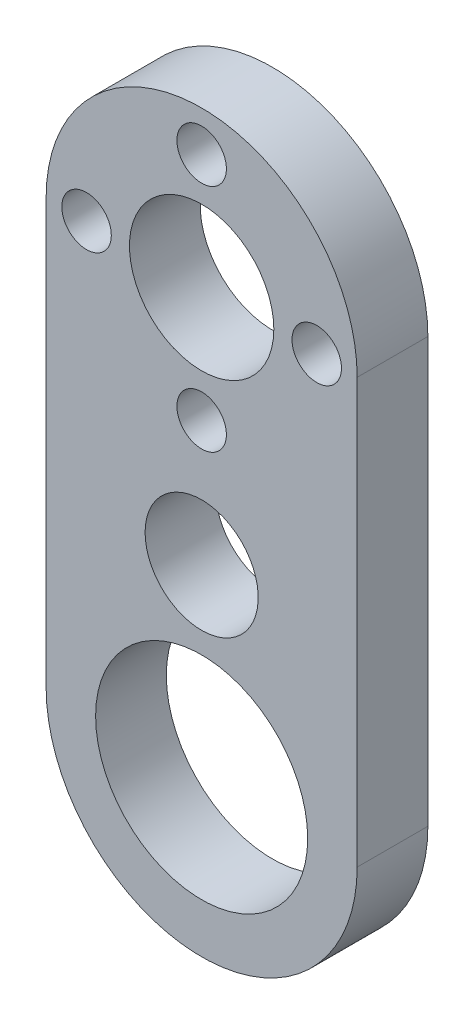
ISO-10303-21;
HEADER;
FILE_DESCRIPTION(('STEP AP214'),'2;1');
FILE_NAME('part.step','',(''),(''),'','','');
FILE_SCHEMA(('AUTOMOTIVE_DESIGN { 1 0 10303 214 1 1 1 1 }'));
ENDSEC;
DATA;
#1=APPLICATION_CONTEXT('core data for automotive mechanical design processes');
#2=APPLICATION_PROTOCOL_DEFINITION('international standard','automotive_design',2000,#1);
#3=PRODUCT_CONTEXT('',#1,'mechanical');
#4=PRODUCT('Part','Part','',(#3));
#5=PRODUCT_RELATED_PRODUCT_CATEGORY('part','',(#4));
#6=PRODUCT_DEFINITION_FORMATION('','',#4);
#7=PRODUCT_DEFINITION_CONTEXT('part definition',#1,'design');
#8=PRODUCT_DEFINITION('design','',#6,#7);
#9=PRODUCT_DEFINITION_SHAPE('','',#8);
#10=(LENGTH_UNIT() NAMED_UNIT(*) SI_UNIT(.MILLI.,.METRE.));
#11=(NAMED_UNIT(*) PLANE_ANGLE_UNIT() SI_UNIT($,.RADIAN.));
#12=(NAMED_UNIT(*) SI_UNIT($,.STERADIAN.) SOLID_ANGLE_UNIT());
#13=UNCERTAINTY_MEASURE_WITH_UNIT(LENGTH_MEASURE(1.E-05),#10,'distance_accuracy_value','');
#14=(GEOMETRIC_REPRESENTATION_CONTEXT(3) GLOBAL_UNCERTAINTY_ASSIGNED_CONTEXT((#13)) GLOBAL_UNIT_ASSIGNED_CONTEXT((#10,
#11,#12)) REPRESENTATION_CONTEXT('',''));
#15=CARTESIAN_POINT('',(0.,0.,0.));
#16=DIRECTION('',(0.,0.,1.));
#17=DIRECTION('',(1.,0.,0.));
#18=AXIS2_PLACEMENT_3D('',#15,#16,#17);
#19=CARTESIAN_POINT('',(0.,0.,5.));
#20=DIRECTION('',(0.,0.,-1.));
#21=DIRECTION('',(-1.,0.,0.));
#22=AXIS2_PLACEMENT_3D('',#19,#20,#21);
#23=CYLINDRICAL_SURFACE('',#22,11.);
#24=DIRECTION('',(0.,0.,-1.));
#25=VECTOR('',#24,1.);
#26=CARTESIAN_POINT('',(-11.,0.,5.));
#27=LINE('',#26,#25);
#28=CARTESIAN_POINT('',(-11.,0.,5.));
#29=VERTEX_POINT('',#28);
#30=CARTESIAN_POINT('',(-11.,0.,0.));
#31=VERTEX_POINT('',#30);
#32=EDGE_CURVE('E56',#29,#31,#27,.T.);
#33=ORIENTED_EDGE('',*,*,#32,.F.);
#34=CARTESIAN_POINT('',(0.,0.,5.));
#35=DIRECTION('',(0.,0.,1.));
#36=DIRECTION('',(1.,0.,0.));
#37=AXIS2_PLACEMENT_3D('',#34,#35,#36);
#38=CIRCLE('',#37,11.);
#39=CARTESIAN_POINT('',(11.,0.,5.));
#40=VERTEX_POINT('',#39);
#41=EDGE_CURVE('E11',#40,#29,#38,.T.);
#42=ORIENTED_EDGE('',*,*,#41,.F.);
#43=DIRECTION('',(0.,0.,-1.));
#44=VECTOR('',#43,1.);
#45=CARTESIAN_POINT('',(11.,0.,5.));
#46=LINE('',#45,#44);
#47=CARTESIAN_POINT('',(11.,0.,0.));
#48=VERTEX_POINT('',#47);
#49=EDGE_CURVE('E87',#40,#48,#46,.T.);
#50=ORIENTED_EDGE('',*,*,#49,.T.);
#51=CARTESIAN_POINT('',(0.,0.,0.));
#52=DIRECTION('',(0.,0.,1.));
#53=DIRECTION('',(1.,0.,0.));
#54=AXIS2_PLACEMENT_3D('',#51,#52,#53);
#55=CIRCLE('',#54,11.);
#56=EDGE_CURVE('E42',#48,#31,#55,.T.);
#57=ORIENTED_EDGE('',*,*,#56,.T.);
#58=EDGE_LOOP('',(#33,#42,#50,#57));
#59=FACE_BOUND('',#58,.T.);
#60=ADVANCED_FACE('F39',(#59),#23,.T.);
#61=CARTESIAN_POINT('',(0.,0.,5.));
#62=DIRECTION('',(0.,0.,1.));
#63=DIRECTION('',(1.,0.,0.));
#64=AXIS2_PLACEMENT_3D('',#61,#62,#63);
#65=PLANE('',#64);
#66=CARTESIAN_POINT('',(8.14,0.,5.));
#67=DIRECTION('',(0.,0.,-1.));
#68=DIRECTION('',(0.,-1.,0.));
#69=AXIS2_PLACEMENT_3D('',#66,#67,#68);
#70=CIRCLE('',#69,1.75);
#71=CARTESIAN_POINT('',(8.14000000000001,-1.74999999999997,5.));
#72=VERTEX_POINT('',#71);
#73=EDGE_CURVE('E116',#72,#72,#70,.T.);
#74=ORIENTED_EDGE('',*,*,#73,.T.);
#75=EDGE_LOOP('',(#74));
#76=FACE_BOUND('',#75,.T.);
#77=CARTESIAN_POINT('',(0.,8.14,5.));
#78=DIRECTION('',(0.,0.,-1.));
#79=DIRECTION('',(1.,0.,0.));
#80=AXIS2_PLACEMENT_3D('',#77,#78,#79);
#81=CIRCLE('',#80,1.75);
#82=CARTESIAN_POINT('',(1.75,8.14,5.));
#83=VERTEX_POINT('',#82);
#84=EDGE_CURVE('E123',#83,#83,#81,.T.);
#85=ORIENTED_EDGE('',*,*,#84,.T.);
#86=EDGE_LOOP('',(#85));
#87=FACE_BOUND('',#86,.T.);
#88=CARTESIAN_POINT('',(-8.14,0.,5.));
#89=DIRECTION('',(0.,0.,-1.));
#90=DIRECTION('',(0.,1.,0.));
#91=AXIS2_PLACEMENT_3D('',#88,#89,#90);
#92=CIRCLE('',#91,1.75);
#93=CARTESIAN_POINT('',(-8.14000000000002,1.74999999999991,5.));
#94=VERTEX_POINT('',#93);
#95=EDGE_CURVE('E129',#94,#94,#92,.T.);
#96=ORIENTED_EDGE('',*,*,#95,.T.);
#97=EDGE_LOOP('',(#96));
#98=FACE_BOUND('',#97,.T.);
#99=CARTESIAN_POINT('',(0.,-8.14,5.));
#100=DIRECTION('',(0.,0.,-1.));
#101=DIRECTION('',(-1.,0.,0.));
#102=AXIS2_PLACEMENT_3D('',#99,#100,#101);
#103=CIRCLE('',#102,1.75);
#104=CARTESIAN_POINT('',(-1.75,-8.14,5.));
#105=VERTEX_POINT('',#104);
#106=EDGE_CURVE('E134',#105,#105,#103,.T.);
#107=ORIENTED_EDGE('',*,*,#106,.T.);
#108=EDGE_LOOP('',(#107));
#109=FACE_BOUND('',#108,.T.);
#110=ORIENTED_EDGE('',*,*,#41,.T.);
#111=DIRECTION('',(0.,1.,0.));
#112=VECTOR('',#111,1.);
#113=CARTESIAN_POINT('',(-11.,0.,5.));
#114=LINE('',#113,#112);
#115=CARTESIAN_POINT('',(-11.,-30.,5.));
#116=VERTEX_POINT('',#115);
#117=EDGE_CURVE('E95',#116,#29,#114,.T.);
#118=ORIENTED_EDGE('',*,*,#117,.F.);
#119=CARTESIAN_POINT('',(0.,-30.,5.));
#120=DIRECTION('',(0.,0.,-1.));
#121=DIRECTION('',(1.,0.,0.));
#122=AXIS2_PLACEMENT_3D('',#119,#120,#121);
#123=CIRCLE('',#122,11.);
#124=CARTESIAN_POINT('',(11.,-30.,5.));
#125=VERTEX_POINT('',#124);
#126=EDGE_CURVE('E78',#125,#116,#123,.T.);
#127=ORIENTED_EDGE('',*,*,#126,.F.);
#128=DIRECTION('',(0.,-1.,0.));
#129=VECTOR('',#128,1.);
#130=CARTESIAN_POINT('',(11.,0.,5.));
#131=LINE('',#130,#129);
#132=EDGE_CURVE('E93',#40,#125,#131,.T.);
#133=ORIENTED_EDGE('',*,*,#132,.F.);
#134=EDGE_LOOP('',(#110,#118,#127,#133));
#135=FACE_BOUND('',#134,.T.);
#136=CARTESIAN_POINT('',(0.,0.,5.));
#137=DIRECTION('',(0.,0.,1.));
#138=DIRECTION('',(1.,0.,0.));
#139=AXIS2_PLACEMENT_3D('',#136,#137,#138);
#140=CIRCLE('',#139,5.105);
#141=CARTESIAN_POINT('',(5.105,0.,5.));
#142=VERTEX_POINT('',#141);
#143=EDGE_CURVE('E140',#142,#142,#140,.T.);
#144=ORIENTED_EDGE('',*,*,#143,.F.);
#145=EDGE_LOOP('',(#144));
#146=FACE_BOUND('',#145,.T.);
#147=CARTESIAN_POINT('',(0.,-17.,5.));
#148=DIRECTION('',(0.,0.,-1.));
#149=DIRECTION('',(-1.,0.,0.));
#150=AXIS2_PLACEMENT_3D('',#147,#148,#149);
#151=CIRCLE('',#150,4.);
#152=CARTESIAN_POINT('',(-4.,-17.,5.));
#153=VERTEX_POINT('',#152);
#154=EDGE_CURVE('E281',#153,#153,#151,.T.);
#155=ORIENTED_EDGE('',*,*,#154,.T.);
#156=EDGE_LOOP('',(#155));
#157=FACE_BOUND('',#156,.T.);
#158=CARTESIAN_POINT('',(0.,-30.,5.));
#159=DIRECTION('',(0.,0.,-1.));
#160=DIRECTION('',(-1.,0.,0.));
#161=AXIS2_PLACEMENT_3D('',#158,#159,#160);
#162=CIRCLE('',#161,7.5);
#163=CARTESIAN_POINT('',(-7.5,-30.,5.));
#164=VERTEX_POINT('',#163);
#165=EDGE_CURVE('E110',#164,#164,#162,.T.);
#166=ORIENTED_EDGE('',*,*,#165,.T.);
#167=EDGE_LOOP('',(#166));
#168=FACE_BOUND('',#167,.T.);
#169=ADVANCED_FACE('F91',(#76,#87,#98,#109,#135,#146,#157,#168),#65,.T.);
#170=CARTESIAN_POINT('',(0.,0.,0.));
#171=DIRECTION('',(0.,0.,1.));
#172=DIRECTION('',(1.,0.,0.));
#173=AXIS2_PLACEMENT_3D('',#170,#171,#172);
#174=PLANE('',#173);
#175=CARTESIAN_POINT('',(8.14,0.,0.));
#176=DIRECTION('',(0.,0.,-1.));
#177=DIRECTION('',(0.,-1.,0.));
#178=AXIS2_PLACEMENT_3D('',#175,#176,#177);
#179=CIRCLE('',#178,1.75);
#180=CARTESIAN_POINT('',(8.14000000000001,-1.74999999999997,0.));
#181=VERTEX_POINT('',#180);
#182=EDGE_CURVE('E120',#181,#181,#179,.T.);
#183=ORIENTED_EDGE('',*,*,#182,.F.);
#184=EDGE_LOOP('',(#183));
#185=FACE_BOUND('',#184,.T.);
#186=CARTESIAN_POINT('',(0.,8.14,0.));
#187=DIRECTION('',(0.,0.,-1.));
#188=DIRECTION('',(1.,0.,0.));
#189=AXIS2_PLACEMENT_3D('',#186,#187,#188);
#190=CIRCLE('',#189,1.75);
#191=CARTESIAN_POINT('',(1.75,8.14,0.));
#192=VERTEX_POINT('',#191);
#193=EDGE_CURVE('E126',#192,#192,#190,.T.);
#194=ORIENTED_EDGE('',*,*,#193,.F.);
#195=EDGE_LOOP('',(#194));
#196=FACE_BOUND('',#195,.T.);
#197=CARTESIAN_POINT('',(-8.14,0.,0.));
#198=DIRECTION('',(0.,0.,-1.));
#199=DIRECTION('',(0.,1.,0.));
#200=AXIS2_PLACEMENT_3D('',#197,#198,#199);
#201=CIRCLE('',#200,1.75);
#202=CARTESIAN_POINT('',(-8.14000000000002,1.74999999999991,0.));
#203=VERTEX_POINT('',#202);
#204=EDGE_CURVE('E113',#203,#203,#201,.T.);
#205=ORIENTED_EDGE('',*,*,#204,.F.);
#206=EDGE_LOOP('',(#205));
#207=FACE_BOUND('',#206,.T.);
#208=CARTESIAN_POINT('',(0.,-8.14,0.));
#209=DIRECTION('',(0.,0.,-1.));
#210=DIRECTION('',(-1.,0.,0.));
#211=AXIS2_PLACEMENT_3D('',#208,#209,#210);
#212=CIRCLE('',#211,1.75);
#213=CARTESIAN_POINT('',(-1.75,-8.14,0.));
#214=VERTEX_POINT('',#213);
#215=EDGE_CURVE('E119',#214,#214,#212,.T.);
#216=ORIENTED_EDGE('',*,*,#215,.F.);
#217=EDGE_LOOP('',(#216));
#218=FACE_BOUND('',#217,.T.);
#219=ORIENTED_EDGE('',*,*,#56,.F.);
#220=DIRECTION('',(0.,-1.,0.));
#221=VECTOR('',#220,1.);
#222=CARTESIAN_POINT('',(11.,0.,0.));
#223=LINE('',#222,#221);
#224=CARTESIAN_POINT('',(11.,-30.,0.));
#225=VERTEX_POINT('',#224);
#226=EDGE_CURVE('E108',#48,#225,#223,.T.);
#227=ORIENTED_EDGE('',*,*,#226,.T.);
#228=CARTESIAN_POINT('',(0.,-30.,0.));
#229=DIRECTION('',(0.,0.,-1.));
#230=DIRECTION('',(1.,0.,0.));
#231=AXIS2_PLACEMENT_3D('',#228,#229,#230);
#232=CIRCLE('',#231,11.);
#233=CARTESIAN_POINT('',(-11.,-30.,0.));
#234=VERTEX_POINT('',#233);
#235=EDGE_CURVE('E81',#225,#234,#232,.T.);
#236=ORIENTED_EDGE('',*,*,#235,.T.);
#237=DIRECTION('',(0.,1.,0.));
#238=VECTOR('',#237,1.);
#239=CARTESIAN_POINT('',(-11.,0.,0.));
#240=LINE('',#239,#238);
#241=EDGE_CURVE('E99',#234,#31,#240,.T.);
#242=ORIENTED_EDGE('',*,*,#241,.T.);
#243=EDGE_LOOP('',(#219,#227,#236,#242));
#244=FACE_BOUND('',#243,.T.);
#245=CARTESIAN_POINT('',(0.,0.,0.));
#246=DIRECTION('',(0.,0.,1.));
#247=DIRECTION('',(1.,0.,0.));
#248=AXIS2_PLACEMENT_3D('',#245,#246,#247);
#249=CIRCLE('',#248,5.105);
#250=CARTESIAN_POINT('',(5.105,0.,0.));
#251=VERTEX_POINT('',#250);
#252=EDGE_CURVE('E137',#251,#251,#249,.T.);
#253=ORIENTED_EDGE('',*,*,#252,.T.);
#254=EDGE_LOOP('',(#253));
#255=FACE_BOUND('',#254,.T.);
#256=CARTESIAN_POINT('',(0.,-17.,0.));
#257=DIRECTION('',(0.,0.,-1.));
#258=DIRECTION('',(-1.,0.,0.));
#259=AXIS2_PLACEMENT_3D('',#256,#257,#258);
#260=CIRCLE('',#259,4.);
#261=CARTESIAN_POINT('',(-4.,-17.,0.));
#262=VERTEX_POINT('',#261);
#263=EDGE_CURVE('E284',#262,#262,#260,.T.);
#264=ORIENTED_EDGE('',*,*,#263,.F.);
#265=EDGE_LOOP('',(#264));
#266=FACE_BOUND('',#265,.T.);
#267=CARTESIAN_POINT('',(0.,-30.,0.));
#268=DIRECTION('',(0.,0.,-1.));
#269=DIRECTION('',(-1.,0.,0.));
#270=AXIS2_PLACEMENT_3D('',#267,#268,#269);
#271=CIRCLE('',#270,7.5);
#272=CARTESIAN_POINT('',(-7.5,-30.,0.));
#273=VERTEX_POINT('',#272);
#274=EDGE_CURVE('E104',#273,#273,#271,.T.);
#275=ORIENTED_EDGE('',*,*,#274,.F.);
#276=EDGE_LOOP('',(#275));
#277=FACE_BOUND('',#276,.T.);
#278=ADVANCED_FACE('F146',(#185,#196,#207,#218,#244,#255,#266,#277),#174,.F.);
#279=CARTESIAN_POINT('',(0.,0.,5.));
#280=DIRECTION('',(0.,0.,-1.));
#281=DIRECTION('',(-1.,0.,0.));
#282=AXIS2_PLACEMENT_3D('',#279,#280,#281);
#283=CYLINDRICAL_SURFACE('',#282,5.105);
#284=ORIENTED_EDGE('',*,*,#143,.T.);
#285=EDGE_LOOP('',(#284));
#286=FACE_BOUND('',#285,.T.);
#287=ORIENTED_EDGE('',*,*,#252,.F.);
#288=EDGE_LOOP('',(#287));
#289=FACE_BOUND('',#288,.T.);
#290=ADVANCED_FACE('F149',(#286,#289),#283,.F.);
#291=CARTESIAN_POINT('',(0.,-8.14,5.));
#292=DIRECTION('',(0.,0.,-1.));
#293=DIRECTION('',(-1.,0.,0.));
#294=AXIS2_PLACEMENT_3D('',#291,#292,#293);
#295=CYLINDRICAL_SURFACE('',#294,1.75);
#296=ORIENTED_EDGE('',*,*,#106,.F.);
#297=EDGE_LOOP('',(#296));
#298=FACE_BOUND('',#297,.T.);
#299=ORIENTED_EDGE('',*,*,#215,.T.);
#300=EDGE_LOOP('',(#299));
#301=FACE_BOUND('',#300,.T.);
#302=ADVANCED_FACE('F151',(#298,#301),#295,.F.);
#303=CARTESIAN_POINT('',(-8.14,0.,5.));
#304=DIRECTION('',(0.,0.,-1.));
#305=DIRECTION('',(-1.,0.,0.));
#306=AXIS2_PLACEMENT_3D('',#303,#304,#305);
#307=CYLINDRICAL_SURFACE('',#306,1.75);
#308=ORIENTED_EDGE('',*,*,#95,.F.);
#309=EDGE_LOOP('',(#308));
#310=FACE_BOUND('',#309,.T.);
#311=ORIENTED_EDGE('',*,*,#204,.T.);
#312=EDGE_LOOP('',(#311));
#313=FACE_BOUND('',#312,.T.);
#314=ADVANCED_FACE('F157',(#310,#313),#307,.F.);
#315=CARTESIAN_POINT('',(0.,8.14,5.));
#316=DIRECTION('',(0.,0.,-1.));
#317=DIRECTION('',(-1.,0.,0.));
#318=AXIS2_PLACEMENT_3D('',#315,#316,#317);
#319=CYLINDRICAL_SURFACE('',#318,1.75);
#320=ORIENTED_EDGE('',*,*,#84,.F.);
#321=EDGE_LOOP('',(#320));
#322=FACE_BOUND('',#321,.T.);
#323=ORIENTED_EDGE('',*,*,#193,.T.);
#324=EDGE_LOOP('',(#323));
#325=FACE_BOUND('',#324,.T.);
#326=ADVANCED_FACE('F194',(#322,#325),#319,.F.);
#327=CARTESIAN_POINT('',(8.14,0.,5.));
#328=DIRECTION('',(0.,0.,-1.));
#329=DIRECTION('',(-1.,0.,0.));
#330=AXIS2_PLACEMENT_3D('',#327,#328,#329);
#331=CYLINDRICAL_SURFACE('',#330,1.75);
#332=ORIENTED_EDGE('',*,*,#73,.F.);
#333=EDGE_LOOP('',(#332));
#334=FACE_BOUND('',#333,.T.);
#335=ORIENTED_EDGE('',*,*,#182,.T.);
#336=EDGE_LOOP('',(#335));
#337=FACE_BOUND('',#336,.T.);
#338=ADVANCED_FACE('F187',(#334,#337),#331,.F.);
#339=CARTESIAN_POINT('',(-11.,0.,5.));
#340=DIRECTION('',(-1.,0.,0.));
#341=DIRECTION('',(0.,-1.,0.));
#342=AXIS2_PLACEMENT_3D('',#339,#340,#341);
#343=PLANE('',#342);
#344=ORIENTED_EDGE('',*,*,#241,.F.);
#345=DIRECTION('',(0.,0.,-1.));
#346=VECTOR('',#345,1.);
#347=CARTESIAN_POINT('',(-11.,-30.,5.));
#348=LINE('',#347,#346);
#349=EDGE_CURVE('E86',#116,#234,#348,.T.);
#350=ORIENTED_EDGE('',*,*,#349,.F.);
#351=ORIENTED_EDGE('',*,*,#117,.T.);
#352=ORIENTED_EDGE('',*,*,#32,.T.);
#353=EDGE_LOOP('',(#344,#350,#351,#352));
#354=FACE_BOUND('',#353,.T.);
#355=ADVANCED_FACE('F185',(#354),#343,.T.);
#356=CARTESIAN_POINT('',(0.,-30.,5.));
#357=DIRECTION('',(0.,0.,-1.));
#358=DIRECTION('',(-1.,0.,0.));
#359=AXIS2_PLACEMENT_3D('',#356,#357,#358);
#360=CYLINDRICAL_SURFACE('',#359,11.);
#361=ORIENTED_EDGE('',*,*,#235,.F.);
#362=DIRECTION('',(0.,0.,-1.));
#363=VECTOR('',#362,1.);
#364=CARTESIAN_POINT('',(11.,-30.,5.));
#365=LINE('',#364,#363);
#366=EDGE_CURVE('E75',#125,#225,#365,.T.);
#367=ORIENTED_EDGE('',*,*,#366,.F.);
#368=ORIENTED_EDGE('',*,*,#126,.T.);
#369=ORIENTED_EDGE('',*,*,#349,.T.);
#370=EDGE_LOOP('',(#361,#367,#368,#369));
#371=FACE_BOUND('',#370,.T.);
#372=ADVANCED_FACE('F77',(#371),#360,.T.);
#373=CARTESIAN_POINT('',(11.,0.,5.));
#374=DIRECTION('',(1.,0.,0.));
#375=DIRECTION('',(0.,1.,0.));
#376=AXIS2_PLACEMENT_3D('',#373,#374,#375);
#377=PLANE('',#376);
#378=ORIENTED_EDGE('',*,*,#226,.F.);
#379=ORIENTED_EDGE('',*,*,#49,.F.);
#380=ORIENTED_EDGE('',*,*,#132,.T.);
#381=ORIENTED_EDGE('',*,*,#366,.T.);
#382=EDGE_LOOP('',(#378,#379,#380,#381));
#383=FACE_BOUND('',#382,.T.);
#384=ADVANCED_FACE('F98',(#383),#377,.T.);
#385=CARTESIAN_POINT('',(0.,-30.,5.));
#386=DIRECTION('',(0.,0.,-1.));
#387=DIRECTION('',(-1.,0.,0.));
#388=AXIS2_PLACEMENT_3D('',#385,#386,#387);
#389=CYLINDRICAL_SURFACE('',#388,7.5);
#390=ORIENTED_EDGE('',*,*,#165,.F.);
#391=EDGE_LOOP('',(#390));
#392=FACE_BOUND('',#391,.T.);
#393=ORIENTED_EDGE('',*,*,#274,.T.);
#394=EDGE_LOOP('',(#393));
#395=FACE_BOUND('',#394,.T.);
#396=ADVANCED_FACE('F198',(#392,#395),#389,.F.);
#397=CARTESIAN_POINT('',(0.,-17.,5.));
#398=DIRECTION('',(0.,0.,-1.));
#399=DIRECTION('',(-1.,0.,0.));
#400=AXIS2_PLACEMENT_3D('',#397,#398,#399);
#401=CYLINDRICAL_SURFACE('',#400,4.);
#402=ORIENTED_EDGE('',*,*,#154,.F.);
#403=EDGE_LOOP('',(#402));
#404=FACE_BOUND('',#403,.T.);
#405=ORIENTED_EDGE('',*,*,#263,.T.);
#406=EDGE_LOOP('',(#405));
#407=FACE_BOUND('',#406,.T.);
#408=ADVANCED_FACE('F265',(#404,#407),#401,.F.);
#409=CLOSED_SHELL('',(#60,#169,#278,#290,#302,#314,#326,#338,#355,#372,#384,#396,#408));
#410=MANIFOLD_SOLID_BREP('B2',#409);
#411=ADVANCED_BREP_SHAPE_REPRESENTATION('',(#18,#410),#14);
#412=SHAPE_DEFINITION_REPRESENTATION(#9,#411);
ENDSEC;
END-ISO-10303-21;
